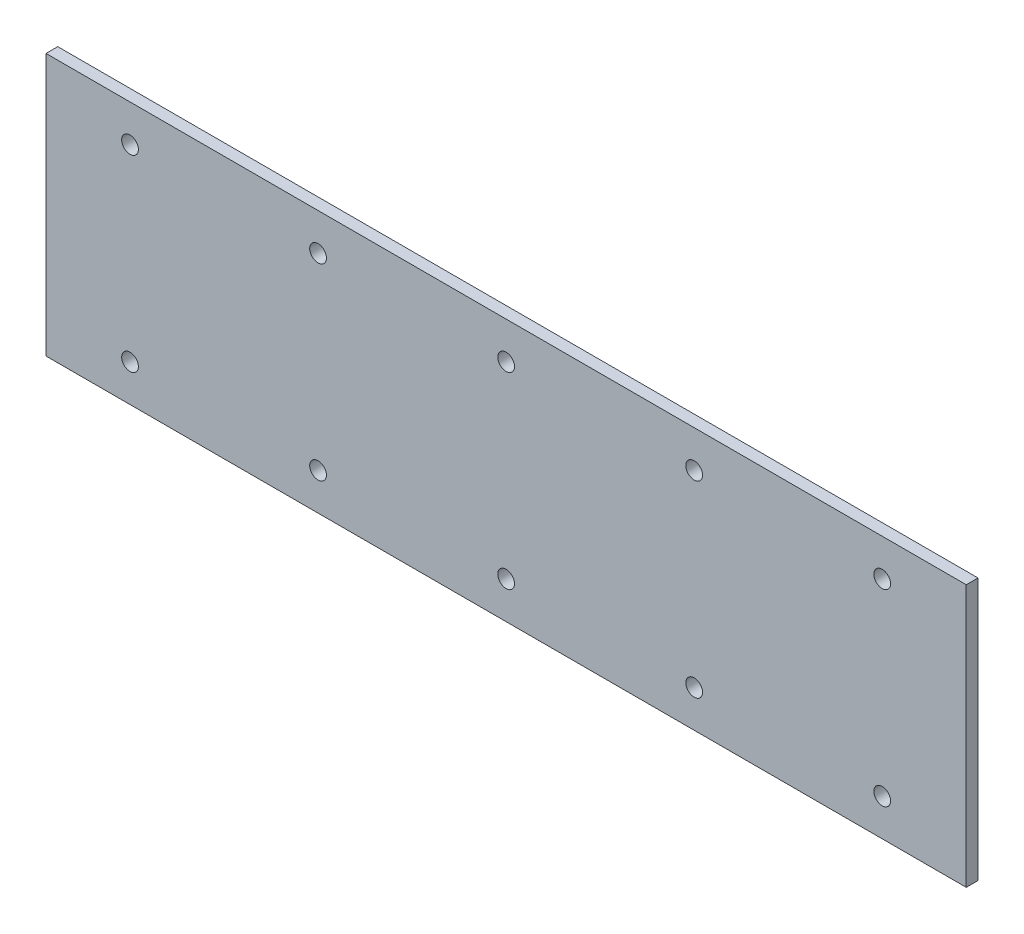
ISO-10303-21;
HEADER;
FILE_DESCRIPTION(('STEP AP214'),'2;1');
FILE_NAME('part.step','',(''),(''),'','','');
FILE_SCHEMA(('AUTOMOTIVE_DESIGN { 1 0 10303 214 1 1 1 1 }'));
ENDSEC;
DATA;
#1=APPLICATION_CONTEXT('core data for automotive mechanical design processes');
#2=APPLICATION_PROTOCOL_DEFINITION('international standard','automotive_design',2000,#1);
#3=PRODUCT_CONTEXT('',#1,'mechanical');
#4=PRODUCT('Part','Part','',(#3));
#5=PRODUCT_RELATED_PRODUCT_CATEGORY('part','',(#4));
#6=PRODUCT_DEFINITION_FORMATION('','',#4);
#7=PRODUCT_DEFINITION_CONTEXT('part definition',#1,'design');
#8=PRODUCT_DEFINITION('design','',#6,#7);
#9=PRODUCT_DEFINITION_SHAPE('','',#8);
#10=(LENGTH_UNIT() NAMED_UNIT(*) SI_UNIT(.MILLI.,.METRE.));
#11=(NAMED_UNIT(*) PLANE_ANGLE_UNIT() SI_UNIT($,.RADIAN.));
#12=(NAMED_UNIT(*) SI_UNIT($,.STERADIAN.) SOLID_ANGLE_UNIT());
#13=UNCERTAINTY_MEASURE_WITH_UNIT(LENGTH_MEASURE(1.E-05),#10,'distance_accuracy_value','');
#14=(GEOMETRIC_REPRESENTATION_CONTEXT(3) GLOBAL_UNCERTAINTY_ASSIGNED_CONTEXT((#13)) GLOBAL_UNIT_ASSIGNED_CONTEXT((#10,
#11,#12)) REPRESENTATION_CONTEXT('',''));
#15=CARTESIAN_POINT('',(0.,0.,0.));
#16=DIRECTION('',(0.,0.,1.));
#17=DIRECTION('',(1.,0.,0.));
#18=AXIS2_PLACEMENT_3D('',#15,#16,#17);
#19=CARTESIAN_POINT('',(-62.15,17.7,1.5875));
#20=DIRECTION('',(1.,0.,0.));
#21=DIRECTION('',(0.,0.,-1.));
#22=AXIS2_PLACEMENT_3D('',#19,#20,#21);
#23=PLANE('',#22);
#24=DIRECTION('',(0.,-1.,0.));
#25=VECTOR('',#24,1.);
#26=CARTESIAN_POINT('',(-62.15,17.7,0.));
#27=LINE('',#26,#25);
#28=CARTESIAN_POINT('',(-62.15,17.7,0.));
#29=VERTEX_POINT('',#28);
#30=CARTESIAN_POINT('',(-62.15,-17.7,0.));
#31=VERTEX_POINT('',#30);
#32=EDGE_CURVE('E111',#29,#31,#27,.T.);
#33=ORIENTED_EDGE('',*,*,#32,.T.);
#34=DIRECTION('',(0.,0.,-1.));
#35=VECTOR('',#34,1.);
#36=CARTESIAN_POINT('',(-62.15,-17.7,1.5875));
#37=LINE('',#36,#35);
#38=CARTESIAN_POINT('',(-62.15,-17.7,1.5875));
#39=VERTEX_POINT('',#38);
#40=EDGE_CURVE('E11',#39,#31,#37,.T.);
#41=ORIENTED_EDGE('',*,*,#40,.F.);
#42=DIRECTION('',(0.,-1.,0.));
#43=VECTOR('',#42,1.);
#44=CARTESIAN_POINT('',(-62.15,17.7,1.5875));
#45=LINE('',#44,#43);
#46=CARTESIAN_POINT('',(-62.15,17.7,1.5875));
#47=VERTEX_POINT('',#46);
#48=EDGE_CURVE('E95',#47,#39,#45,.T.);
#49=ORIENTED_EDGE('',*,*,#48,.F.);
#50=DIRECTION('',(0.,0.,-1.));
#51=VECTOR('',#50,1.);
#52=CARTESIAN_POINT('',(-62.15,17.7,1.5875));
#53=LINE('',#52,#51);
#54=EDGE_CURVE('E107',#47,#29,#53,.T.);
#55=ORIENTED_EDGE('',*,*,#54,.T.);
#56=EDGE_LOOP('',(#33,#41,#49,#55));
#57=FACE_BOUND('',#56,.T.);
#58=ADVANCED_FACE('F43',(#57),#23,.F.);
#59=CARTESIAN_POINT('',(-62.15,-17.7,1.5875));
#60=DIRECTION('',(0.,1.,0.));
#61=DIRECTION('',(-1.,0.,0.));
#62=AXIS2_PLACEMENT_3D('',#59,#60,#61);
#63=PLANE('',#62);
#64=DIRECTION('',(1.,0.,0.));
#65=VECTOR('',#64,1.);
#66=CARTESIAN_POINT('',(-62.15,-17.7,0.));
#67=LINE('',#66,#65);
#68=CARTESIAN_POINT('',(62.15,-17.7,0.));
#69=VERTEX_POINT('',#68);
#70=EDGE_CURVE('E100',#31,#69,#67,.T.);
#71=ORIENTED_EDGE('',*,*,#70,.T.);
#72=DIRECTION('',(0.,0.,-1.));
#73=VECTOR('',#72,1.);
#74=CARTESIAN_POINT('',(62.15,-17.7,1.5875));
#75=LINE('',#74,#73);
#76=CARTESIAN_POINT('',(62.15,-17.7,1.5875));
#77=VERTEX_POINT('',#76);
#78=EDGE_CURVE('E52',#77,#69,#75,.T.);
#79=ORIENTED_EDGE('',*,*,#78,.F.);
#80=DIRECTION('',(1.,0.,0.));
#81=VECTOR('',#80,1.);
#82=CARTESIAN_POINT('',(-62.15,-17.7,1.5875));
#83=LINE('',#82,#81);
#84=EDGE_CURVE('E90',#39,#77,#83,.T.);
#85=ORIENTED_EDGE('',*,*,#84,.F.);
#86=ORIENTED_EDGE('',*,*,#40,.T.);
#87=EDGE_LOOP('',(#71,#79,#85,#86));
#88=FACE_BOUND('',#87,.T.);
#89=ADVANCED_FACE('F99',(#88),#63,.F.);
#90=CARTESIAN_POINT('',(62.15,17.7,1.5875));
#91=DIRECTION('',(-1.,0.,0.));
#92=DIRECTION('',(0.,0.,1.));
#93=AXIS2_PLACEMENT_3D('',#90,#91,#92);
#94=PLANE('',#93);
#95=DIRECTION('',(0.,1.,0.));
#96=VECTOR('',#95,1.);
#97=CARTESIAN_POINT('',(62.15,17.7,0.));
#98=LINE('',#97,#96);
#99=CARTESIAN_POINT('',(62.15,17.7,0.));
#100=VERTEX_POINT('',#99);
#101=EDGE_CURVE('E77',#69,#100,#98,.T.);
#102=ORIENTED_EDGE('',*,*,#101,.T.);
#103=DIRECTION('',(0.,0.,-1.));
#104=VECTOR('',#103,1.);
#105=CARTESIAN_POINT('',(62.15,17.7,1.5875));
#106=LINE('',#105,#104);
#107=CARTESIAN_POINT('',(62.15,17.7,1.5875));
#108=VERTEX_POINT('',#107);
#109=EDGE_CURVE('E102',#108,#100,#106,.T.);
#110=ORIENTED_EDGE('',*,*,#109,.F.);
#111=DIRECTION('',(0.,1.,0.));
#112=VECTOR('',#111,1.);
#113=CARTESIAN_POINT('',(62.15,17.7,1.5875));
#114=LINE('',#113,#112);
#115=EDGE_CURVE('E93',#77,#108,#114,.T.);
#116=ORIENTED_EDGE('',*,*,#115,.F.);
#117=ORIENTED_EDGE('',*,*,#78,.T.);
#118=EDGE_LOOP('',(#102,#110,#116,#117));
#119=FACE_BOUND('',#118,.T.);
#120=ADVANCED_FACE('F103',(#119),#94,.F.);
#121=CARTESIAN_POINT('',(-62.15,17.7,1.5875));
#122=DIRECTION('',(0.,-1.,0.));
#123=DIRECTION('',(1.,0.,0.));
#124=AXIS2_PLACEMENT_3D('',#121,#122,#123);
#125=PLANE('',#124);
#126=DIRECTION('',(-1.,0.,0.));
#127=VECTOR('',#126,1.);
#128=CARTESIAN_POINT('',(-62.15,17.7,0.));
#129=LINE('',#128,#127);
#130=EDGE_CURVE('E83',#100,#29,#129,.T.);
#131=ORIENTED_EDGE('',*,*,#130,.T.);
#132=ORIENTED_EDGE('',*,*,#54,.F.);
#133=DIRECTION('',(-1.,0.,0.));
#134=VECTOR('',#133,1.);
#135=CARTESIAN_POINT('',(-62.15,17.7,1.5875));
#136=LINE('',#135,#134);
#137=EDGE_CURVE('E60',#108,#47,#136,.T.);
#138=ORIENTED_EDGE('',*,*,#137,.F.);
#139=ORIENTED_EDGE('',*,*,#109,.T.);
#140=EDGE_LOOP('',(#131,#132,#138,#139));
#141=FACE_BOUND('',#140,.T.);
#142=ADVANCED_FACE('F125',(#141),#125,.F.);
#143=CARTESIAN_POINT('',(0.,0.,1.5875));
#144=DIRECTION('',(0.,0.,1.));
#145=DIRECTION('',(1.,0.,0.));
#146=AXIS2_PLACEMENT_3D('',#143,#144,#145);
#147=PLANE('',#146);
#148=CARTESIAN_POINT('',(50.8,12.7,1.5875));
#149=DIRECTION('',(0.,0.,1.));
#150=DIRECTION('',(1.,0.,0.));
#151=AXIS2_PLACEMENT_3D('',#148,#149,#150);
#152=CIRCLE('',#151,1.13029999999999);
#153=CARTESIAN_POINT('',(51.9303,12.7,1.5875));
#154=VERTEX_POINT('',#153);
#155=EDGE_CURVE('E207',#154,#154,#152,.T.);
#156=ORIENTED_EDGE('',*,*,#155,.F.);
#157=EDGE_LOOP('',(#156));
#158=FACE_BOUND('',#157,.T.);
#159=CARTESIAN_POINT('',(50.8,-12.7,1.5875));
#160=DIRECTION('',(0.,0.,1.));
#161=DIRECTION('',(1.,0.,0.));
#162=AXIS2_PLACEMENT_3D('',#159,#160,#161);
#163=CIRCLE('',#162,1.13029999999999);
#164=CARTESIAN_POINT('',(51.9303,-12.7,1.5875));
#165=VERTEX_POINT('',#164);
#166=EDGE_CURVE('E199',#165,#165,#163,.T.);
#167=ORIENTED_EDGE('',*,*,#166,.F.);
#168=EDGE_LOOP('',(#167));
#169=FACE_BOUND('',#168,.T.);
#170=CARTESIAN_POINT('',(25.4,12.7,1.5875));
#171=DIRECTION('',(0.,0.,1.));
#172=DIRECTION('',(1.,0.,0.));
#173=AXIS2_PLACEMENT_3D('',#170,#171,#172);
#174=CIRCLE('',#173,1.13029999999999);
#175=CARTESIAN_POINT('',(26.5303,12.7,1.5875));
#176=VERTEX_POINT('',#175);
#177=EDGE_CURVE('E191',#176,#176,#174,.T.);
#178=ORIENTED_EDGE('',*,*,#177,.F.);
#179=EDGE_LOOP('',(#178));
#180=FACE_BOUND('',#179,.T.);
#181=CARTESIAN_POINT('',(25.4,-12.7,1.5875));
#182=DIRECTION('',(0.,0.,1.));
#183=DIRECTION('',(1.,0.,0.));
#184=AXIS2_PLACEMENT_3D('',#181,#182,#183);
#185=CIRCLE('',#184,1.13029999999999);
#186=CARTESIAN_POINT('',(26.5303,-12.7,1.5875));
#187=VERTEX_POINT('',#186);
#188=EDGE_CURVE('E183',#187,#187,#185,.T.);
#189=ORIENTED_EDGE('',*,*,#188,.F.);
#190=EDGE_LOOP('',(#189));
#191=FACE_BOUND('',#190,.T.);
#192=CARTESIAN_POINT('',(0.,12.7,1.5875));
#193=DIRECTION('',(0.,0.,1.));
#194=DIRECTION('',(1.,0.,0.));
#195=AXIS2_PLACEMENT_3D('',#192,#193,#194);
#196=CIRCLE('',#195,1.13029999999999);
#197=CARTESIAN_POINT('',(1.13029999999999,12.7,1.5875));
#198=VERTEX_POINT('',#197);
#199=EDGE_CURVE('E175',#198,#198,#196,.T.);
#200=ORIENTED_EDGE('',*,*,#199,.F.);
#201=EDGE_LOOP('',(#200));
#202=FACE_BOUND('',#201,.T.);
#203=CARTESIAN_POINT('',(0.,-12.7,1.5875));
#204=DIRECTION('',(0.,0.,1.));
#205=DIRECTION('',(1.,0.,0.));
#206=AXIS2_PLACEMENT_3D('',#203,#204,#205);
#207=CIRCLE('',#206,1.13029999999999);
#208=CARTESIAN_POINT('',(1.13029999999999,-12.7,1.5875));
#209=VERTEX_POINT('',#208);
#210=EDGE_CURVE('E167',#209,#209,#207,.T.);
#211=ORIENTED_EDGE('',*,*,#210,.F.);
#212=EDGE_LOOP('',(#211));
#213=FACE_BOUND('',#212,.T.);
#214=CARTESIAN_POINT('',(-25.4,12.7,1.5875));
#215=DIRECTION('',(0.,0.,1.));
#216=DIRECTION('',(1.,0.,0.));
#217=AXIS2_PLACEMENT_3D('',#214,#215,#216);
#218=CIRCLE('',#217,1.13029999999999);
#219=CARTESIAN_POINT('',(-24.2697,12.7,1.5875));
#220=VERTEX_POINT('',#219);
#221=EDGE_CURVE('E159',#220,#220,#218,.T.);
#222=ORIENTED_EDGE('',*,*,#221,.F.);
#223=EDGE_LOOP('',(#222));
#224=FACE_BOUND('',#223,.T.);
#225=CARTESIAN_POINT('',(-25.4,-12.7,1.5875));
#226=DIRECTION('',(0.,0.,1.));
#227=DIRECTION('',(1.,0.,0.));
#228=AXIS2_PLACEMENT_3D('',#225,#226,#227);
#229=CIRCLE('',#228,1.13029999999999);
#230=CARTESIAN_POINT('',(-24.2697,-12.7,1.5875));
#231=VERTEX_POINT('',#230);
#232=EDGE_CURVE('E151',#231,#231,#229,.T.);
#233=ORIENTED_EDGE('',*,*,#232,.F.);
#234=EDGE_LOOP('',(#233));
#235=FACE_BOUND('',#234,.T.);
#236=CARTESIAN_POINT('',(-50.8,12.7,1.5875));
#237=DIRECTION('',(0.,0.,1.));
#238=DIRECTION('',(1.,0.,0.));
#239=AXIS2_PLACEMENT_3D('',#236,#237,#238);
#240=CIRCLE('',#239,1.13029999999999);
#241=CARTESIAN_POINT('',(-49.6697,12.7,1.5875));
#242=VERTEX_POINT('',#241);
#243=EDGE_CURVE('E143',#242,#242,#240,.T.);
#244=ORIENTED_EDGE('',*,*,#243,.F.);
#245=EDGE_LOOP('',(#244));
#246=FACE_BOUND('',#245,.T.);
#247=CARTESIAN_POINT('',(-50.8,-12.7,1.5875));
#248=DIRECTION('',(0.,0.,1.));
#249=DIRECTION('',(1.,0.,0.));
#250=AXIS2_PLACEMENT_3D('',#247,#248,#249);
#251=CIRCLE('',#250,1.13029999999999);
#252=CARTESIAN_POINT('',(-49.6697,-12.7,1.5875));
#253=VERTEX_POINT('',#252);
#254=EDGE_CURVE('E135',#253,#253,#251,.T.);
#255=ORIENTED_EDGE('',*,*,#254,.F.);
#256=EDGE_LOOP('',(#255));
#257=FACE_BOUND('',#256,.T.);
#258=ORIENTED_EDGE('',*,*,#48,.T.);
#259=ORIENTED_EDGE('',*,*,#84,.T.);
#260=ORIENTED_EDGE('',*,*,#115,.T.);
#261=ORIENTED_EDGE('',*,*,#137,.T.);
#262=EDGE_LOOP('',(#258,#259,#260,#261));
#263=FACE_BOUND('',#262,.T.);
#264=ADVANCED_FACE('F91',(#158,#169,#180,#191,#202,#213,#224,#235,#246,#257,#263),#147,.T.);
#265=CARTESIAN_POINT('',(0.,0.,0.));
#266=DIRECTION('',(0.,0.,1.));
#267=DIRECTION('',(1.,0.,0.));
#268=AXIS2_PLACEMENT_3D('',#265,#266,#267);
#269=PLANE('',#268);
#270=CARTESIAN_POINT('',(50.8,12.7,0.));
#271=DIRECTION('',(0.,0.,1.));
#272=DIRECTION('',(1.,0.,0.));
#273=AXIS2_PLACEMENT_3D('',#270,#271,#272);
#274=CIRCLE('',#273,1.1303);
#275=CARTESIAN_POINT('',(51.9303,12.7,0.));
#276=VERTEX_POINT('',#275);
#277=EDGE_CURVE('E203',#276,#276,#274,.T.);
#278=ORIENTED_EDGE('',*,*,#277,.T.);
#279=EDGE_LOOP('',(#278));
#280=FACE_BOUND('',#279,.T.);
#281=CARTESIAN_POINT('',(50.8,-12.7,0.));
#282=DIRECTION('',(0.,0.,1.));
#283=DIRECTION('',(1.,0.,0.));
#284=AXIS2_PLACEMENT_3D('',#281,#282,#283);
#285=CIRCLE('',#284,1.1303);
#286=CARTESIAN_POINT('',(51.9303,-12.7,0.));
#287=VERTEX_POINT('',#286);
#288=EDGE_CURVE('E195',#287,#287,#285,.T.);
#289=ORIENTED_EDGE('',*,*,#288,.T.);
#290=EDGE_LOOP('',(#289));
#291=FACE_BOUND('',#290,.T.);
#292=CARTESIAN_POINT('',(25.4,12.7,0.));
#293=DIRECTION('',(0.,0.,1.));
#294=DIRECTION('',(1.,0.,0.));
#295=AXIS2_PLACEMENT_3D('',#292,#293,#294);
#296=CIRCLE('',#295,1.1303);
#297=CARTESIAN_POINT('',(26.5303,12.7,0.));
#298=VERTEX_POINT('',#297);
#299=EDGE_CURVE('E187',#298,#298,#296,.T.);
#300=ORIENTED_EDGE('',*,*,#299,.T.);
#301=EDGE_LOOP('',(#300));
#302=FACE_BOUND('',#301,.T.);
#303=CARTESIAN_POINT('',(25.4,-12.7,0.));
#304=DIRECTION('',(0.,0.,1.));
#305=DIRECTION('',(1.,0.,0.));
#306=AXIS2_PLACEMENT_3D('',#303,#304,#305);
#307=CIRCLE('',#306,1.1303);
#308=CARTESIAN_POINT('',(26.5303,-12.7,0.));
#309=VERTEX_POINT('',#308);
#310=EDGE_CURVE('E179',#309,#309,#307,.T.);
#311=ORIENTED_EDGE('',*,*,#310,.T.);
#312=EDGE_LOOP('',(#311));
#313=FACE_BOUND('',#312,.T.);
#314=CARTESIAN_POINT('',(0.,12.7,0.));
#315=DIRECTION('',(0.,0.,1.));
#316=DIRECTION('',(1.,0.,0.));
#317=AXIS2_PLACEMENT_3D('',#314,#315,#316);
#318=CIRCLE('',#317,1.1303);
#319=CARTESIAN_POINT('',(1.1303,12.7,0.));
#320=VERTEX_POINT('',#319);
#321=EDGE_CURVE('E171',#320,#320,#318,.T.);
#322=ORIENTED_EDGE('',*,*,#321,.T.);
#323=EDGE_LOOP('',(#322));
#324=FACE_BOUND('',#323,.T.);
#325=CARTESIAN_POINT('',(0.,-12.7,0.));
#326=DIRECTION('',(0.,0.,1.));
#327=DIRECTION('',(1.,0.,0.));
#328=AXIS2_PLACEMENT_3D('',#325,#326,#327);
#329=CIRCLE('',#328,1.1303);
#330=CARTESIAN_POINT('',(1.1303,-12.7,0.));
#331=VERTEX_POINT('',#330);
#332=EDGE_CURVE('E163',#331,#331,#329,.T.);
#333=ORIENTED_EDGE('',*,*,#332,.T.);
#334=EDGE_LOOP('',(#333));
#335=FACE_BOUND('',#334,.T.);
#336=CARTESIAN_POINT('',(-25.4,12.7,0.));
#337=DIRECTION('',(0.,0.,1.));
#338=DIRECTION('',(1.,0.,0.));
#339=AXIS2_PLACEMENT_3D('',#336,#337,#338);
#340=CIRCLE('',#339,1.1303);
#341=CARTESIAN_POINT('',(-24.2697,12.7,0.));
#342=VERTEX_POINT('',#341);
#343=EDGE_CURVE('E155',#342,#342,#340,.T.);
#344=ORIENTED_EDGE('',*,*,#343,.T.);
#345=EDGE_LOOP('',(#344));
#346=FACE_BOUND('',#345,.T.);
#347=CARTESIAN_POINT('',(-25.4,-12.7,0.));
#348=DIRECTION('',(0.,0.,1.));
#349=DIRECTION('',(1.,0.,0.));
#350=AXIS2_PLACEMENT_3D('',#347,#348,#349);
#351=CIRCLE('',#350,1.1303);
#352=CARTESIAN_POINT('',(-24.2697,-12.7,0.));
#353=VERTEX_POINT('',#352);
#354=EDGE_CURVE('E147',#353,#353,#351,.T.);
#355=ORIENTED_EDGE('',*,*,#354,.T.);
#356=EDGE_LOOP('',(#355));
#357=FACE_BOUND('',#356,.T.);
#358=CARTESIAN_POINT('',(-50.8,12.7,0.));
#359=DIRECTION('',(0.,0.,1.));
#360=DIRECTION('',(1.,0.,0.));
#361=AXIS2_PLACEMENT_3D('',#358,#359,#360);
#362=CIRCLE('',#361,1.1303);
#363=CARTESIAN_POINT('',(-49.6697,12.7,0.));
#364=VERTEX_POINT('',#363);
#365=EDGE_CURVE('E139',#364,#364,#362,.T.);
#366=ORIENTED_EDGE('',*,*,#365,.T.);
#367=EDGE_LOOP('',(#366));
#368=FACE_BOUND('',#367,.T.);
#369=CARTESIAN_POINT('',(-50.8,-12.7,0.));
#370=DIRECTION('',(0.,0.,1.));
#371=DIRECTION('',(1.,0.,0.));
#372=AXIS2_PLACEMENT_3D('',#369,#370,#371);
#373=CIRCLE('',#372,1.1303);
#374=CARTESIAN_POINT('',(-49.6697,-12.7,0.));
#375=VERTEX_POINT('',#374);
#376=EDGE_CURVE('E115',#375,#375,#373,.T.);
#377=ORIENTED_EDGE('',*,*,#376,.T.);
#378=EDGE_LOOP('',(#377));
#379=FACE_BOUND('',#378,.T.);
#380=ORIENTED_EDGE('',*,*,#32,.F.);
#381=ORIENTED_EDGE('',*,*,#130,.F.);
#382=ORIENTED_EDGE('',*,*,#101,.F.);
#383=ORIENTED_EDGE('',*,*,#70,.F.);
#384=EDGE_LOOP('',(#380,#381,#382,#383));
#385=FACE_BOUND('',#384,.T.);
#386=ADVANCED_FACE('F128',(#280,#291,#302,#313,#324,#335,#346,#357,#368,#379,#385),#269,.F.);
#387=CARTESIAN_POINT('',(-50.8,-12.7,1.5875));
#388=DIRECTION('',(0.,0.,1.));
#389=DIRECTION('',(1.,0.,0.));
#390=AXIS2_PLACEMENT_3D('',#387,#388,#389);
#391=CYLINDRICAL_SURFACE('',#390,1.13029999999999);
#392=ORIENTED_EDGE('',*,*,#376,.F.);
#393=EDGE_LOOP('',(#392));
#394=FACE_BOUND('',#393,.T.);
#395=ORIENTED_EDGE('',*,*,#254,.T.);
#396=EDGE_LOOP('',(#395));
#397=FACE_BOUND('',#396,.T.);
#398=ADVANCED_FACE('F235',(#394,#397),#391,.F.);
#399=CARTESIAN_POINT('',(-50.8,12.7,1.5875));
#400=DIRECTION('',(0.,0.,1.));
#401=DIRECTION('',(1.,0.,0.));
#402=AXIS2_PLACEMENT_3D('',#399,#400,#401);
#403=CYLINDRICAL_SURFACE('',#402,1.13029999999999);
#404=ORIENTED_EDGE('',*,*,#365,.F.);
#405=EDGE_LOOP('',(#404));
#406=FACE_BOUND('',#405,.T.);
#407=ORIENTED_EDGE('',*,*,#243,.T.);
#408=EDGE_LOOP('',(#407));
#409=FACE_BOUND('',#408,.T.);
#410=ADVANCED_FACE('F237',(#406,#409),#403,.F.);
#411=CARTESIAN_POINT('',(-25.4,-12.7,1.5875));
#412=DIRECTION('',(0.,0.,1.));
#413=DIRECTION('',(1.,0.,0.));
#414=AXIS2_PLACEMENT_3D('',#411,#412,#413);
#415=CYLINDRICAL_SURFACE('',#414,1.13029999999999);
#416=ORIENTED_EDGE('',*,*,#354,.F.);
#417=EDGE_LOOP('',(#416));
#418=FACE_BOUND('',#417,.T.);
#419=ORIENTED_EDGE('',*,*,#232,.T.);
#420=EDGE_LOOP('',(#419));
#421=FACE_BOUND('',#420,.T.);
#422=ADVANCED_FACE('F244',(#418,#421),#415,.F.);
#423=CARTESIAN_POINT('',(-25.4,12.7,1.5875));
#424=DIRECTION('',(0.,0.,1.));
#425=DIRECTION('',(1.,0.,0.));
#426=AXIS2_PLACEMENT_3D('',#423,#424,#425);
#427=CYLINDRICAL_SURFACE('',#426,1.13029999999999);
#428=ORIENTED_EDGE('',*,*,#343,.F.);
#429=EDGE_LOOP('',(#428));
#430=FACE_BOUND('',#429,.T.);
#431=ORIENTED_EDGE('',*,*,#221,.T.);
#432=EDGE_LOOP('',(#431));
#433=FACE_BOUND('',#432,.T.);
#434=ADVANCED_FACE('F286',(#430,#433),#427,.F.);
#435=CARTESIAN_POINT('',(0.,-12.7,1.5875));
#436=DIRECTION('',(0.,0.,1.));
#437=DIRECTION('',(1.,0.,0.));
#438=AXIS2_PLACEMENT_3D('',#435,#436,#437);
#439=CYLINDRICAL_SURFACE('',#438,1.13029999999999);
#440=ORIENTED_EDGE('',*,*,#332,.F.);
#441=EDGE_LOOP('',(#440));
#442=FACE_BOUND('',#441,.T.);
#443=ORIENTED_EDGE('',*,*,#210,.T.);
#444=EDGE_LOOP('',(#443));
#445=FACE_BOUND('',#444,.T.);
#446=ADVANCED_FACE('F301',(#442,#445),#439,.F.);
#447=CARTESIAN_POINT('',(0.,12.7,1.5875));
#448=DIRECTION('',(0.,0.,1.));
#449=DIRECTION('',(1.,0.,0.));
#450=AXIS2_PLACEMENT_3D('',#447,#448,#449);
#451=CYLINDRICAL_SURFACE('',#450,1.13029999999999);
#452=ORIENTED_EDGE('',*,*,#321,.F.);
#453=EDGE_LOOP('',(#452));
#454=FACE_BOUND('',#453,.T.);
#455=ORIENTED_EDGE('',*,*,#199,.T.);
#456=EDGE_LOOP('',(#455));
#457=FACE_BOUND('',#456,.T.);
#458=ADVANCED_FACE('F315',(#454,#457),#451,.F.);
#459=CARTESIAN_POINT('',(25.4,-12.7,1.5875));
#460=DIRECTION('',(0.,0.,1.));
#461=DIRECTION('',(1.,0.,0.));
#462=AXIS2_PLACEMENT_3D('',#459,#460,#461);
#463=CYLINDRICAL_SURFACE('',#462,1.13029999999999);
#464=ORIENTED_EDGE('',*,*,#310,.F.);
#465=EDGE_LOOP('',(#464));
#466=FACE_BOUND('',#465,.T.);
#467=ORIENTED_EDGE('',*,*,#188,.T.);
#468=EDGE_LOOP('',(#467));
#469=FACE_BOUND('',#468,.T.);
#470=ADVANCED_FACE('F328',(#466,#469),#463,.F.);
#471=CARTESIAN_POINT('',(25.4,12.7,1.5875));
#472=DIRECTION('',(0.,0.,1.));
#473=DIRECTION('',(1.,0.,0.));
#474=AXIS2_PLACEMENT_3D('',#471,#472,#473);
#475=CYLINDRICAL_SURFACE('',#474,1.13029999999999);
#476=ORIENTED_EDGE('',*,*,#299,.F.);
#477=EDGE_LOOP('',(#476));
#478=FACE_BOUND('',#477,.T.);
#479=ORIENTED_EDGE('',*,*,#177,.T.);
#480=EDGE_LOOP('',(#479));
#481=FACE_BOUND('',#480,.T.);
#482=ADVANCED_FACE('F339',(#478,#481),#475,.F.);
#483=CARTESIAN_POINT('',(50.8,-12.7,1.5875));
#484=DIRECTION('',(0.,0.,1.));
#485=DIRECTION('',(1.,0.,0.));
#486=AXIS2_PLACEMENT_3D('',#483,#484,#485);
#487=CYLINDRICAL_SURFACE('',#486,1.13029999999999);
#488=ORIENTED_EDGE('',*,*,#288,.F.);
#489=EDGE_LOOP('',(#488));
#490=FACE_BOUND('',#489,.T.);
#491=ORIENTED_EDGE('',*,*,#166,.T.);
#492=EDGE_LOOP('',(#491));
#493=FACE_BOUND('',#492,.T.);
#494=ADVANCED_FACE('F350',(#490,#493),#487,.F.);
#495=CARTESIAN_POINT('',(50.8,12.7,1.5875));
#496=DIRECTION('',(0.,0.,1.));
#497=DIRECTION('',(1.,0.,0.));
#498=AXIS2_PLACEMENT_3D('',#495,#496,#497);
#499=CYLINDRICAL_SURFACE('',#498,1.13029999999999);
#500=ORIENTED_EDGE('',*,*,#277,.F.);
#501=EDGE_LOOP('',(#500));
#502=FACE_BOUND('',#501,.T.);
#503=ORIENTED_EDGE('',*,*,#155,.T.);
#504=EDGE_LOOP('',(#503));
#505=FACE_BOUND('',#504,.T.);
#506=ADVANCED_FACE('F212',(#502,#505),#499,.F.);
#507=CLOSED_SHELL('',(#58,#89,#120,#142,#264,#386,#398,#410,#422,#434,#446,#458,#470,#482,#494,#506));
#508=MANIFOLD_SOLID_BREP('B2',#507);
#509=ADVANCED_BREP_SHAPE_REPRESENTATION('',(#18,#508),#14);
#510=SHAPE_DEFINITION_REPRESENTATION(#9,#509);
ENDSEC;
END-ISO-10303-21;
